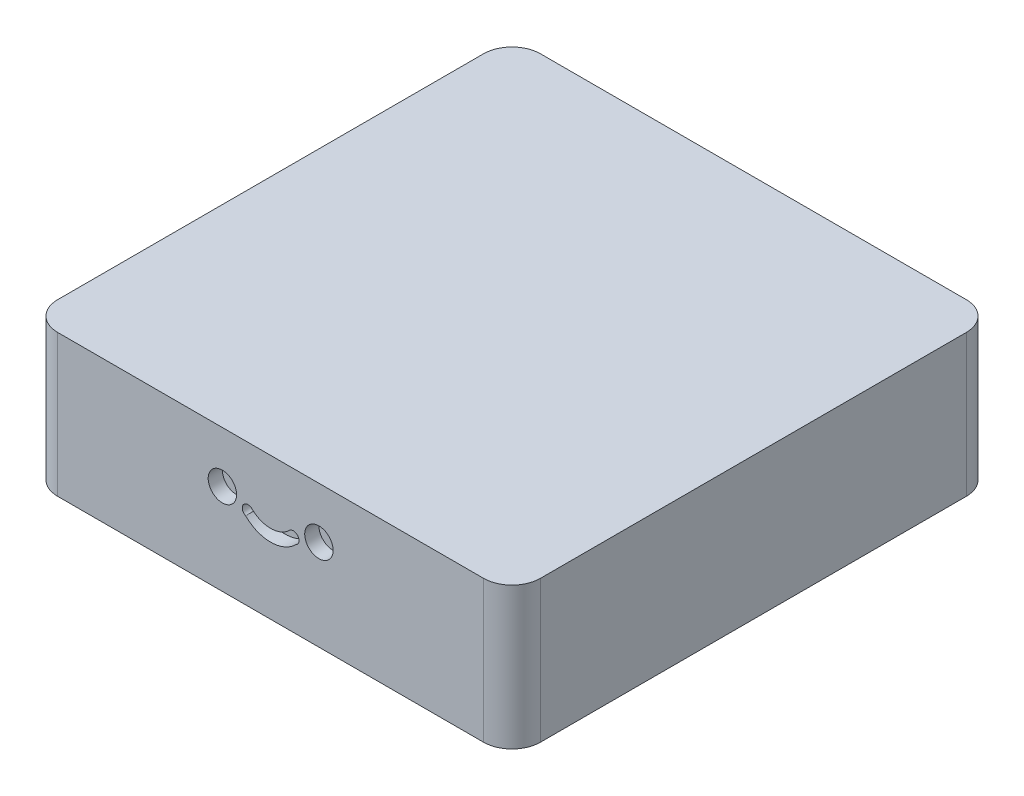
ISO-10303-21;
HEADER;
FILE_DESCRIPTION(('STEP AP214'),'2;1');
FILE_NAME('part.step','',(''),(''),'','','');
FILE_SCHEMA(('AUTOMOTIVE_DESIGN { 1 0 10303 214 1 1 1 1 }'));
ENDSEC;
DATA;
#1=APPLICATION_CONTEXT('core data for automotive mechanical design processes');
#2=APPLICATION_PROTOCOL_DEFINITION('international standard','automotive_design',2000,#1);
#3=PRODUCT_CONTEXT('',#1,'mechanical');
#4=PRODUCT('Part','Part','',(#3));
#5=PRODUCT_RELATED_PRODUCT_CATEGORY('part','',(#4));
#6=PRODUCT_DEFINITION_FORMATION('','',#4);
#7=PRODUCT_DEFINITION_CONTEXT('part definition',#1,'design');
#8=PRODUCT_DEFINITION('design','',#6,#7);
#9=PRODUCT_DEFINITION_SHAPE('','',#8);
#10=(LENGTH_UNIT() NAMED_UNIT(*) SI_UNIT(.MILLI.,.METRE.));
#11=(NAMED_UNIT(*) PLANE_ANGLE_UNIT() SI_UNIT($,.RADIAN.));
#12=(NAMED_UNIT(*) SI_UNIT($,.STERADIAN.) SOLID_ANGLE_UNIT());
#13=UNCERTAINTY_MEASURE_WITH_UNIT(LENGTH_MEASURE(1.E-05),#10,'distance_accuracy_value','');
#14=(GEOMETRIC_REPRESENTATION_CONTEXT(3) GLOBAL_UNCERTAINTY_ASSIGNED_CONTEXT((#13)) GLOBAL_UNIT_ASSIGNED_CONTEXT((#10,
#11,#12)) REPRESENTATION_CONTEXT('',''));
#15=CARTESIAN_POINT('',(0.,0.,0.));
#16=DIRECTION('',(0.,0.,1.));
#17=DIRECTION('',(1.,0.,0.));
#18=AXIS2_PLACEMENT_3D('',#15,#16,#17);
#19=CARTESIAN_POINT('',(0.,0.,0.));
#20=DIRECTION('',(0.,-1.,0.));
#21=DIRECTION('',(0.,0.,-1.));
#22=AXIS2_PLACEMENT_3D('',#19,#20,#21);
#23=PLANE('',#22);
#24=DIRECTION('',(0.,0.,1.));
#25=VECTOR('',#24,1.);
#26=CARTESIAN_POINT('',(0.,0.,0.));
#27=LINE('',#26,#25);
#28=CARTESIAN_POINT('',(0.,0.,-160.));
#29=VERTEX_POINT('',#28);
#30=CARTESIAN_POINT('',(0.,0.,-10.));
#31=VERTEX_POINT('',#30);
#32=EDGE_CURVE('E336',#29,#31,#27,.T.);
#33=ORIENTED_EDGE('',*,*,#32,.F.);
#34=CARTESIAN_POINT('',(10.,0.,-160.));
#35=DIRECTION('',(0.,-1.,0.));
#36=DIRECTION('',(0.,0.,-1.));
#37=AXIS2_PLACEMENT_3D('',#34,#35,#36);
#38=CIRCLE('',#37,10.);
#39=CARTESIAN_POINT('',(10.,0.,-170.));
#40=VERTEX_POINT('',#39);
#41=EDGE_CURVE('E408',#29,#40,#38,.T.);
#42=ORIENTED_EDGE('',*,*,#41,.T.);
#43=DIRECTION('',(-1.,0.,0.));
#44=VECTOR('',#43,1.);
#45=CARTESIAN_POINT('',(0.,0.,-170.));
#46=LINE('',#45,#44);
#47=CARTESIAN_POINT('',(160.,0.,-170.));
#48=VERTEX_POINT('',#47);
#49=EDGE_CURVE('E378',#48,#40,#46,.T.);
#50=ORIENTED_EDGE('',*,*,#49,.F.);
#51=CARTESIAN_POINT('',(160.,0.,-160.));
#52=DIRECTION('',(0.,-1.,0.));
#53=DIRECTION('',(0.,0.,-1.));
#54=AXIS2_PLACEMENT_3D('',#51,#52,#53);
#55=CIRCLE('',#54,10.);
#56=CARTESIAN_POINT('',(170.,0.,-160.));
#57=VERTEX_POINT('',#56);
#58=EDGE_CURVE('E406',#48,#57,#55,.T.);
#59=ORIENTED_EDGE('',*,*,#58,.T.);
#60=DIRECTION('',(0.,0.,-1.));
#61=VECTOR('',#60,1.);
#62=CARTESIAN_POINT('',(170.,0.,0.));
#63=LINE('',#62,#61);
#64=CARTESIAN_POINT('',(170.,0.,-10.));
#65=VERTEX_POINT('',#64);
#66=EDGE_CURVE('E393',#65,#57,#63,.T.);
#67=ORIENTED_EDGE('',*,*,#66,.F.);
#68=CARTESIAN_POINT('',(160.,0.,-10.));
#69=DIRECTION('',(0.,-1.,0.));
#70=DIRECTION('',(0.,0.,-1.));
#71=AXIS2_PLACEMENT_3D('',#68,#69,#70);
#72=CIRCLE('',#71,10.);
#73=CARTESIAN_POINT('',(160.,0.,0.));
#74=VERTEX_POINT('',#73);
#75=EDGE_CURVE('E402',#65,#74,#72,.T.);
#76=ORIENTED_EDGE('',*,*,#75,.T.);
#77=DIRECTION('',(1.,0.,0.));
#78=VECTOR('',#77,1.);
#79=CARTESIAN_POINT('',(0.,0.,0.));
#80=LINE('',#79,#78);
#81=CARTESIAN_POINT('',(10.,0.,0.));
#82=VERTEX_POINT('',#81);
#83=EDGE_CURVE('E390',#82,#74,#80,.T.);
#84=ORIENTED_EDGE('',*,*,#83,.F.);
#85=CARTESIAN_POINT('',(10.,0.,-10.));
#86=DIRECTION('',(0.,-1.,0.));
#87=DIRECTION('',(0.,0.,-1.));
#88=AXIS2_PLACEMENT_3D('',#85,#86,#87);
#89=CIRCLE('',#88,10.);
#90=EDGE_CURVE('E404',#82,#31,#89,.T.);
#91=ORIENTED_EDGE('',*,*,#90,.T.);
#92=EDGE_LOOP('',(#33,#42,#50,#59,#67,#76,#84,#91));
#93=FACE_BOUND('',#92,.T.);
#94=CARTESIAN_POINT('',(10.,0.,-160.));
#95=DIRECTION('',(0.,-1.,0.));
#96=DIRECTION('',(0.,0.,-1.));
#97=AXIS2_PLACEMENT_3D('',#94,#95,#96);
#98=CIRCLE('',#97,7.);
#99=CARTESIAN_POINT('',(3.,0.,-160.));
#100=VERTEX_POINT('',#99);
#101=CARTESIAN_POINT('',(10.,0.,-167.));
#102=VERTEX_POINT('',#101);
#103=EDGE_CURVE('E269',#100,#102,#98,.T.);
#104=ORIENTED_EDGE('',*,*,#103,.F.);
#105=DIRECTION('',(0.,0.,1.));
#106=VECTOR('',#105,1.);
#107=CARTESIAN_POINT('',(3.,0.,0.));
#108=LINE('',#107,#106);
#109=CARTESIAN_POINT('',(3.,0.,-10.));
#110=VERTEX_POINT('',#109);
#111=EDGE_CURVE('E308',#100,#110,#108,.T.);
#112=ORIENTED_EDGE('',*,*,#111,.T.);
#113=CARTESIAN_POINT('',(10.,0.,-10.));
#114=DIRECTION('',(0.,-1.,0.));
#115=DIRECTION('',(0.,0.,-1.));
#116=AXIS2_PLACEMENT_3D('',#113,#114,#115);
#117=CIRCLE('',#116,7.);
#118=CARTESIAN_POINT('',(10.,0.,-3.));
#119=VERTEX_POINT('',#118);
#120=EDGE_CURVE('E311',#119,#110,#117,.T.);
#121=ORIENTED_EDGE('',*,*,#120,.F.);
#122=DIRECTION('',(1.,0.,0.));
#123=VECTOR('',#122,1.);
#124=CARTESIAN_POINT('',(0.,0.,-3.));
#125=LINE('',#124,#123);
#126=CARTESIAN_POINT('',(160.,0.,-3.));
#127=VERTEX_POINT('',#126);
#128=EDGE_CURVE('E55',#119,#127,#125,.T.);
#129=ORIENTED_EDGE('',*,*,#128,.T.);
#130=CARTESIAN_POINT('',(160.,0.,-10.));
#131=DIRECTION('',(0.,-1.,0.));
#132=DIRECTION('',(0.,0.,-1.));
#133=AXIS2_PLACEMENT_3D('',#130,#131,#132);
#134=CIRCLE('',#133,7.);
#135=CARTESIAN_POINT('',(167.,0.,-10.));
#136=VERTEX_POINT('',#135);
#137=EDGE_CURVE('E233',#136,#127,#134,.T.);
#138=ORIENTED_EDGE('',*,*,#137,.F.);
#139=DIRECTION('',(0.,0.,-1.));
#140=VECTOR('',#139,1.);
#141=CARTESIAN_POINT('',(167.,0.,0.));
#142=LINE('',#141,#140);
#143=CARTESIAN_POINT('',(167.,0.,-160.));
#144=VERTEX_POINT('',#143);
#145=EDGE_CURVE('E310',#136,#144,#142,.T.);
#146=ORIENTED_EDGE('',*,*,#145,.T.);
#147=CARTESIAN_POINT('',(160.,0.,-160.));
#148=DIRECTION('',(0.,-1.,0.));
#149=DIRECTION('',(0.,0.,-1.));
#150=AXIS2_PLACEMENT_3D('',#147,#148,#149);
#151=CIRCLE('',#150,7.);
#152=CARTESIAN_POINT('',(160.,0.,-167.));
#153=VERTEX_POINT('',#152);
#154=EDGE_CURVE('E313',#153,#144,#151,.T.);
#155=ORIENTED_EDGE('',*,*,#154,.F.);
#156=DIRECTION('',(-1.,0.,0.));
#157=VECTOR('',#156,1.);
#158=CARTESIAN_POINT('',(0.,0.,-167.));
#159=LINE('',#158,#157);
#160=EDGE_CURVE('E317',#153,#102,#159,.T.);
#161=ORIENTED_EDGE('',*,*,#160,.T.);
#162=EDGE_LOOP('',(#104,#112,#121,#129,#138,#146,#155,#161));
#163=FACE_BOUND('',#162,.T.);
#164=ADVANCED_FACE('F40',(#93,#163),#23,.T.);
#165=CARTESIAN_POINT('',(0.,50.,0.));
#166=DIRECTION('',(0.,0.,-1.));
#167=DIRECTION('',(-1.,0.,0.));
#168=AXIS2_PLACEMENT_3D('',#165,#166,#167);
#169=PLANE('',#168);
#170=CARTESIAN_POINT('',(68.,32.,0.));
#171=DIRECTION('',(0.,0.,1.));
#172=DIRECTION('',(1.,0.,0.));
#173=AXIS2_PLACEMENT_3D('',#170,#171,#172);
#174=CIRCLE('',#173,5.00000000000001);
#175=CARTESIAN_POINT('',(73.,32.,0.));
#176=VERTEX_POINT('',#175);
#177=EDGE_CURVE('E337',#176,#176,#174,.T.);
#178=ORIENTED_EDGE('',*,*,#177,.F.);
#179=EDGE_LOOP('',(#178));
#180=FACE_BOUND('',#179,.T.);
#181=DIRECTION('',(1.,0.,0.));
#182=VECTOR('',#181,1.);
#183=CARTESIAN_POINT('',(0.,50.,0.));
#184=LINE('',#183,#182);
#185=CARTESIAN_POINT('',(10.,50.,0.));
#186=VERTEX_POINT('',#185);
#187=CARTESIAN_POINT('',(160.,50.,0.));
#188=VERTEX_POINT('',#187);
#189=EDGE_CURVE('E377',#186,#188,#184,.T.);
#190=ORIENTED_EDGE('',*,*,#189,.F.);
#191=DIRECTION('',(0.,-1.,0.));
#192=VECTOR('',#191,1.);
#193=CARTESIAN_POINT('',(10.,50.,0.));
#194=LINE('',#193,#192);
#195=EDGE_CURVE('E12',#186,#82,#194,.T.);
#196=ORIENTED_EDGE('',*,*,#195,.T.);
#197=ORIENTED_EDGE('',*,*,#83,.T.);
#198=DIRECTION('',(0.,-1.,0.));
#199=VECTOR('',#198,1.);
#200=CARTESIAN_POINT('',(160.,50.,0.));
#201=LINE('',#200,#199);
#202=EDGE_CURVE('E48',#74,#188,#201,.F.);
#203=ORIENTED_EDGE('',*,*,#202,.T.);
#204=EDGE_LOOP('',(#190,#196,#197,#203));
#205=FACE_BOUND('',#204,.T.);
#206=CARTESIAN_POINT('',(102.,32.,0.));
#207=DIRECTION('',(0.,0.,1.));
#208=DIRECTION('',(1.,0.,0.));
#209=AXIS2_PLACEMENT_3D('',#206,#207,#208);
#210=CIRCLE('',#209,5.00000000000001);
#211=CARTESIAN_POINT('',(107.,32.,0.));
#212=VERTEX_POINT('',#211);
#213=EDGE_CURVE('E332',#212,#212,#210,.T.);
#214=ORIENTED_EDGE('',*,*,#213,.F.);
#215=EDGE_LOOP('',(#214));
#216=FACE_BOUND('',#215,.T.);
#217=CARTESIAN_POINT('',(85.,37.1309503384281,0.));
#218=DIRECTION('',(0.,0.,1.));
#219=DIRECTION('',(1.,0.,0.));
#220=AXIS2_PLACEMENT_3D('',#217,#218,#219);
#221=CIRCLE('',#220,9.40844902005735);
#222=CARTESIAN_POINT('',(78.4561054884062,30.3710422337161,0.));
#223=VERTEX_POINT('',#222);
#224=CARTESIAN_POINT('',(91.6527781025305,30.4781722358977,0.));
#225=VERTEX_POINT('',#224);
#226=EDGE_CURVE('E63',#223,#225,#221,.T.);
#227=ORIENTED_EDGE('',*,*,#226,.T.);
#228=CARTESIAN_POINT('',(93.,29.,0.));
#229=DIRECTION('',(0.,0.,1.));
#230=DIRECTION('',(1.,0.,0.));
#231=AXIS2_PLACEMENT_3D('',#228,#229,#230);
#232=CIRCLE('',#231,2.);
#233=CARTESIAN_POINT('',(93.8421104782793,27.1859300062092,0.));
#234=VERTEX_POINT('',#233);
#235=EDGE_CURVE('E345',#225,#234,#232,.F.);
#236=ORIENTED_EDGE('',*,*,#235,.T.);
#237=CARTESIAN_POINT('',(85.0073184568654,36.0084889303069,0.));
#238=DIRECTION('',(0.,0.,1.));
#239=DIRECTION('',(1.,0.,0.));
#240=AXIS2_PLACEMENT_3D('',#237,#238,#239);
#241=CIRCLE('',#240,12.485635587779);
#242=CARTESIAN_POINT('',(76.1847595327677,27.173696908893,0.));
#243=VERTEX_POINT('',#242);
#244=EDGE_CURVE('E359',#243,#234,#241,.T.);
#245=ORIENTED_EDGE('',*,*,#244,.F.);
#246=CARTESIAN_POINT('',(77.,29.,0.));
#247=DIRECTION('',(0.,0.,1.));
#248=DIRECTION('',(1.,0.,0.));
#249=AXIS2_PLACEMENT_3D('',#246,#247,#248);
#250=CIRCLE('',#249,2.);
#251=EDGE_CURVE('E355',#223,#243,#250,.T.);
#252=ORIENTED_EDGE('',*,*,#251,.F.);
#253=EDGE_LOOP('',(#227,#236,#245,#252));
#254=FACE_BOUND('',#253,.T.);
#255=ADVANCED_FACE('F430',(#180,#205,#216,#254),#169,.F.);
#256=CARTESIAN_POINT('',(0.,50.,0.));
#257=DIRECTION('',(1.,0.,0.));
#258=DIRECTION('',(0.,0.,-1.));
#259=AXIS2_PLACEMENT_3D('',#256,#257,#258);
#260=PLANE('',#259);
#261=DIRECTION('',(0.,0.,1.));
#262=VECTOR('',#261,1.);
#263=CARTESIAN_POINT('',(0.,50.,0.));
#264=LINE('',#263,#262);
#265=CARTESIAN_POINT('',(0.,50.,-160.));
#266=VERTEX_POINT('',#265);
#267=CARTESIAN_POINT('',(0.,50.,-10.));
#268=VERTEX_POINT('',#267);
#269=EDGE_CURVE('E374',#266,#268,#264,.T.);
#270=ORIENTED_EDGE('',*,*,#269,.F.);
#271=DIRECTION('',(0.,-1.,0.));
#272=VECTOR('',#271,1.);
#273=CARTESIAN_POINT('',(0.,50.,-160.));
#274=LINE('',#273,#272);
#275=EDGE_CURVE('E399',#266,#29,#274,.T.);
#276=ORIENTED_EDGE('',*,*,#275,.T.);
#277=ORIENTED_EDGE('',*,*,#32,.T.);
#278=DIRECTION('',(0.,-1.,0.));
#279=VECTOR('',#278,1.);
#280=CARTESIAN_POINT('',(0.,50.,-10.));
#281=LINE('',#280,#279);
#282=EDGE_CURVE('E387',#31,#268,#281,.F.);
#283=ORIENTED_EDGE('',*,*,#282,.T.);
#284=EDGE_LOOP('',(#270,#276,#277,#283));
#285=FACE_BOUND('',#284,.T.);
#286=ADVANCED_FACE('F463',(#285),#260,.F.);
#287=CARTESIAN_POINT('',(170.,50.,0.));
#288=DIRECTION('',(-1.,0.,0.));
#289=DIRECTION('',(0.,0.,1.));
#290=AXIS2_PLACEMENT_3D('',#287,#288,#289);
#291=PLANE('',#290);
#292=ORIENTED_EDGE('',*,*,#66,.T.);
#293=DIRECTION('',(0.,-1.,0.));
#294=VECTOR('',#293,1.);
#295=CARTESIAN_POINT('',(170.,50.,-160.));
#296=LINE('',#295,#294);
#297=CARTESIAN_POINT('',(170.,50.,-160.));
#298=VERTEX_POINT('',#297);
#299=EDGE_CURVE('E426',#57,#298,#296,.F.);
#300=ORIENTED_EDGE('',*,*,#299,.T.);
#301=DIRECTION('',(0.,0.,-1.));
#302=VECTOR('',#301,1.);
#303=CARTESIAN_POINT('',(170.,50.,0.));
#304=LINE('',#303,#302);
#305=CARTESIAN_POINT('',(170.,50.,-10.));
#306=VERTEX_POINT('',#305);
#307=EDGE_CURVE('E381',#306,#298,#304,.T.);
#308=ORIENTED_EDGE('',*,*,#307,.F.);
#309=DIRECTION('',(0.,-1.,0.));
#310=VECTOR('',#309,1.);
#311=CARTESIAN_POINT('',(170.,50.,-10.));
#312=LINE('',#311,#310);
#313=EDGE_CURVE('E423',#306,#65,#312,.T.);
#314=ORIENTED_EDGE('',*,*,#313,.T.);
#315=EDGE_LOOP('',(#292,#300,#308,#314));
#316=FACE_BOUND('',#315,.T.);
#317=ADVANCED_FACE('F443',(#316),#291,.F.);
#318=CARTESIAN_POINT('',(0.,50.,-170.));
#319=DIRECTION('',(0.,0.,1.));
#320=DIRECTION('',(1.,0.,0.));
#321=AXIS2_PLACEMENT_3D('',#318,#319,#320);
#322=PLANE('',#321);
#323=ORIENTED_EDGE('',*,*,#49,.T.);
#324=DIRECTION('',(0.,-1.,0.));
#325=VECTOR('',#324,1.);
#326=CARTESIAN_POINT('',(10.,50.,-170.));
#327=LINE('',#326,#325);
#328=CARTESIAN_POINT('',(10.,50.,-170.));
#329=VERTEX_POINT('',#328);
#330=EDGE_CURVE('E413',#40,#329,#327,.F.);
#331=ORIENTED_EDGE('',*,*,#330,.T.);
#332=DIRECTION('',(-1.,0.,0.));
#333=VECTOR('',#332,1.);
#334=CARTESIAN_POINT('',(0.,50.,-170.));
#335=LINE('',#334,#333);
#336=CARTESIAN_POINT('',(160.,50.,-170.));
#337=VERTEX_POINT('',#336);
#338=EDGE_CURVE('E384',#337,#329,#335,.T.);
#339=ORIENTED_EDGE('',*,*,#338,.F.);
#340=DIRECTION('',(0.,-1.,0.));
#341=VECTOR('',#340,1.);
#342=CARTESIAN_POINT('',(160.,50.,-170.));
#343=LINE('',#342,#341);
#344=EDGE_CURVE('E410',#337,#48,#343,.T.);
#345=ORIENTED_EDGE('',*,*,#344,.T.);
#346=EDGE_LOOP('',(#323,#331,#339,#345));
#347=FACE_BOUND('',#346,.T.);
#348=ADVANCED_FACE('F455',(#347),#322,.F.);
#349=CARTESIAN_POINT('',(0.,50.,0.));
#350=DIRECTION('',(0.,-1.,0.));
#351=DIRECTION('',(0.,0.,-1.));
#352=AXIS2_PLACEMENT_3D('',#349,#350,#351);
#353=PLANE('',#352);
#354=ORIENTED_EDGE('',*,*,#338,.T.);
#355=CARTESIAN_POINT('',(10.,50.,-160.));
#356=DIRECTION('',(0.,-1.,0.));
#357=DIRECTION('',(0.,0.,-1.));
#358=AXIS2_PLACEMENT_3D('',#355,#356,#357);
#359=CIRCLE('',#358,10.);
#360=EDGE_CURVE('E421',#329,#266,#359,.F.);
#361=ORIENTED_EDGE('',*,*,#360,.T.);
#362=ORIENTED_EDGE('',*,*,#269,.T.);
#363=CARTESIAN_POINT('',(10.,50.,-10.));
#364=DIRECTION('',(0.,-1.,0.));
#365=DIRECTION('',(0.,0.,-1.));
#366=AXIS2_PLACEMENT_3D('',#363,#364,#365);
#367=CIRCLE('',#366,10.);
#368=EDGE_CURVE('E417',#268,#186,#367,.F.);
#369=ORIENTED_EDGE('',*,*,#368,.T.);
#370=ORIENTED_EDGE('',*,*,#189,.T.);
#371=CARTESIAN_POINT('',(160.,50.,-10.));
#372=DIRECTION('',(0.,-1.,0.));
#373=DIRECTION('',(0.,0.,-1.));
#374=AXIS2_PLACEMENT_3D('',#371,#372,#373);
#375=CIRCLE('',#374,10.);
#376=EDGE_CURVE('E415',#188,#306,#375,.F.);
#377=ORIENTED_EDGE('',*,*,#376,.T.);
#378=ORIENTED_EDGE('',*,*,#307,.T.);
#379=CARTESIAN_POINT('',(160.,50.,-160.));
#380=DIRECTION('',(0.,-1.,0.));
#381=DIRECTION('',(0.,0.,-1.));
#382=AXIS2_PLACEMENT_3D('',#379,#380,#381);
#383=CIRCLE('',#382,10.);
#384=EDGE_CURVE('E419',#298,#337,#383,.F.);
#385=ORIENTED_EDGE('',*,*,#384,.T.);
#386=EDGE_LOOP('',(#354,#361,#362,#369,#370,#377,#378,#385));
#387=FACE_BOUND('',#386,.T.);
#388=ADVANCED_FACE('F437',(#387),#353,.F.);
#389=CARTESIAN_POINT('',(10.,50.,-160.));
#390=DIRECTION('',(0.,-1.,0.));
#391=DIRECTION('',(0.,0.,-1.));
#392=AXIS2_PLACEMENT_3D('',#389,#390,#391);
#393=CYLINDRICAL_SURFACE('',#392,10.);
#394=ORIENTED_EDGE('',*,*,#360,.F.);
#395=ORIENTED_EDGE('',*,*,#330,.F.);
#396=ORIENTED_EDGE('',*,*,#41,.F.);
#397=ORIENTED_EDGE('',*,*,#275,.F.);
#398=EDGE_LOOP('',(#394,#395,#396,#397));
#399=FACE_BOUND('',#398,.T.);
#400=ADVANCED_FACE('F461',(#399),#393,.T.);
#401=CARTESIAN_POINT('',(160.,50.,-160.));
#402=DIRECTION('',(0.,-1.,0.));
#403=DIRECTION('',(0.,0.,-1.));
#404=AXIS2_PLACEMENT_3D('',#401,#402,#403);
#405=CYLINDRICAL_SURFACE('',#404,10.);
#406=ORIENTED_EDGE('',*,*,#384,.F.);
#407=ORIENTED_EDGE('',*,*,#299,.F.);
#408=ORIENTED_EDGE('',*,*,#58,.F.);
#409=ORIENTED_EDGE('',*,*,#344,.F.);
#410=EDGE_LOOP('',(#406,#407,#408,#409));
#411=FACE_BOUND('',#410,.T.);
#412=ADVANCED_FACE('F452',(#411),#405,.T.);
#413=CARTESIAN_POINT('',(10.,50.,-10.));
#414=DIRECTION('',(0.,-1.,0.));
#415=DIRECTION('',(0.,0.,-1.));
#416=AXIS2_PLACEMENT_3D('',#413,#414,#415);
#417=CYLINDRICAL_SURFACE('',#416,10.);
#418=ORIENTED_EDGE('',*,*,#368,.F.);
#419=ORIENTED_EDGE('',*,*,#282,.F.);
#420=ORIENTED_EDGE('',*,*,#90,.F.);
#421=ORIENTED_EDGE('',*,*,#195,.F.);
#422=EDGE_LOOP('',(#418,#419,#420,#421));
#423=FACE_BOUND('',#422,.T.);
#424=ADVANCED_FACE('F466',(#423),#417,.T.);
#425=CARTESIAN_POINT('',(160.,50.,-10.));
#426=DIRECTION('',(0.,-1.,0.));
#427=DIRECTION('',(0.,0.,-1.));
#428=AXIS2_PLACEMENT_3D('',#425,#426,#427);
#429=CYLINDRICAL_SURFACE('',#428,10.);
#430=ORIENTED_EDGE('',*,*,#376,.F.);
#431=ORIENTED_EDGE('',*,*,#202,.F.);
#432=ORIENTED_EDGE('',*,*,#75,.F.);
#433=ORIENTED_EDGE('',*,*,#313,.F.);
#434=EDGE_LOOP('',(#430,#431,#432,#433));
#435=FACE_BOUND('',#434,.T.);
#436=ADVANCED_FACE('F42',(#435),#429,.T.);
#437=CARTESIAN_POINT('',(102.,32.,-5.));
#438=DIRECTION('',(0.,0.,1.));
#439=DIRECTION('',(1.,0.,0.));
#440=AXIS2_PLACEMENT_3D('',#437,#438,#439);
#441=CYLINDRICAL_SURFACE('',#440,5.00000000000001);
#442=CARTESIAN_POINT('',(102.,32.,-5.));
#443=DIRECTION('',(0.,0.,1.));
#444=DIRECTION('',(1.,0.,0.));
#445=AXIS2_PLACEMENT_3D('',#442,#443,#444);
#446=CIRCLE('',#445,5.00000000000001);
#447=CARTESIAN_POINT('',(107.,32.,-5.));
#448=VERTEX_POINT('',#447);
#449=EDGE_CURVE('E356',#448,#448,#446,.T.);
#450=ORIENTED_EDGE('',*,*,#449,.F.);
#451=EDGE_LOOP('',(#450));
#452=FACE_BOUND('',#451,.T.);
#453=ORIENTED_EDGE('',*,*,#213,.T.);
#454=EDGE_LOOP('',(#453));
#455=FACE_BOUND('',#454,.T.);
#456=ADVANCED_FACE('F472',(#452,#455),#441,.F.);
#457=CARTESIAN_POINT('',(0.,0.,-5.));
#458=DIRECTION('',(0.,0.,1.));
#459=DIRECTION('',(1.,0.,0.));
#460=AXIS2_PLACEMENT_3D('',#457,#458,#459);
#461=PLANE('',#460);
#462=ORIENTED_EDGE('',*,*,#449,.T.);
#463=EDGE_LOOP('',(#462));
#464=FACE_BOUND('',#463,.T.);
#465=ADVANCED_FACE('F528',(#464),#461,.T.);
#466=CARTESIAN_POINT('',(85.,37.1309503384281,-5.));
#467=DIRECTION('',(0.,0.,1.));
#468=DIRECTION('',(1.,0.,0.));
#469=AXIS2_PLACEMENT_3D('',#466,#467,#468);
#470=CYLINDRICAL_SURFACE('',#469,9.40844902005735);
#471=ORIENTED_EDGE('',*,*,#226,.F.);
#472=DIRECTION('',(0.,0.,1.));
#473=VECTOR('',#472,1.);
#474=CARTESIAN_POINT('',(78.4561054884062,30.3710422337161,-5.));
#475=LINE('',#474,#473);
#476=CARTESIAN_POINT('',(78.4561054884062,30.3710422337161,-5.));
#477=VERTEX_POINT('',#476);
#478=EDGE_CURVE('E353',#477,#223,#475,.T.);
#479=ORIENTED_EDGE('',*,*,#478,.F.);
#480=CARTESIAN_POINT('',(85.,37.1309503384281,-5.));
#481=DIRECTION('',(0.,0.,1.));
#482=DIRECTION('',(1.,0.,0.));
#483=AXIS2_PLACEMENT_3D('',#480,#481,#482);
#484=CIRCLE('',#483,9.40844902005735);
#485=CARTESIAN_POINT('',(91.6527781025305,30.4781722358977,-5.));
#486=VERTEX_POINT('',#485);
#487=EDGE_CURVE('E341',#477,#486,#484,.T.);
#488=ORIENTED_EDGE('',*,*,#487,.T.);
#489=DIRECTION('',(0.,0.,1.));
#490=VECTOR('',#489,1.);
#491=CARTESIAN_POINT('',(91.6527781025305,30.4781722358977,-5.));
#492=LINE('',#491,#490);
#493=EDGE_CURVE('E340',#486,#225,#492,.T.);
#494=ORIENTED_EDGE('',*,*,#493,.T.);
#495=EDGE_LOOP('',(#471,#479,#488,#494));
#496=FACE_BOUND('',#495,.T.);
#497=ADVANCED_FACE('F537',(#496),#470,.T.);
#498=CARTESIAN_POINT('',(93.,29.,-5.));
#499=DIRECTION('',(0.,0.,1.));
#500=DIRECTION('',(1.,0.,0.));
#501=AXIS2_PLACEMENT_3D('',#498,#499,#500);
#502=CYLINDRICAL_SURFACE('',#501,2.);
#503=ORIENTED_EDGE('',*,*,#235,.F.);
#504=ORIENTED_EDGE('',*,*,#493,.F.);
#505=CARTESIAN_POINT('',(93.,29.,-5.));
#506=DIRECTION('',(0.,0.,1.));
#507=DIRECTION('',(1.,0.,0.));
#508=AXIS2_PLACEMENT_3D('',#505,#506,#507);
#509=CIRCLE('',#508,2.);
#510=CARTESIAN_POINT('',(93.8421104782793,27.1859300062092,-5.));
#511=VERTEX_POINT('',#510);
#512=EDGE_CURVE('E351',#486,#511,#509,.F.);
#513=ORIENTED_EDGE('',*,*,#512,.T.);
#514=DIRECTION('',(0.,0.,1.));
#515=VECTOR('',#514,1.);
#516=CARTESIAN_POINT('',(93.8421104782793,27.1859300062092,-5.));
#517=LINE('',#516,#515);
#518=EDGE_CURVE('E365',#511,#234,#517,.T.);
#519=ORIENTED_EDGE('',*,*,#518,.T.);
#520=EDGE_LOOP('',(#503,#504,#513,#519));
#521=FACE_BOUND('',#520,.T.);
#522=ADVANCED_FACE('F548',(#521),#502,.F.);
#523=CARTESIAN_POINT('',(85.0073184568654,36.0084889303069,-5.));
#524=DIRECTION('',(0.,0.,1.));
#525=DIRECTION('',(1.,0.,0.));
#526=AXIS2_PLACEMENT_3D('',#523,#524,#525);
#527=CYLINDRICAL_SURFACE('',#526,12.485635587779);
#528=ORIENTED_EDGE('',*,*,#244,.T.);
#529=ORIENTED_EDGE('',*,*,#518,.F.);
#530=CARTESIAN_POINT('',(85.0073184568654,36.0084889303069,-5.));
#531=DIRECTION('',(0.,0.,1.));
#532=DIRECTION('',(1.,0.,0.));
#533=AXIS2_PLACEMENT_3D('',#530,#531,#532);
#534=CIRCLE('',#533,12.485635587779);
#535=CARTESIAN_POINT('',(76.1847595327677,27.173696908893,-5.));
#536=VERTEX_POINT('',#535);
#537=EDGE_CURVE('E348',#536,#511,#534,.T.);
#538=ORIENTED_EDGE('',*,*,#537,.F.);
#539=DIRECTION('',(0.,0.,1.));
#540=VECTOR('',#539,1.);
#541=CARTESIAN_POINT('',(76.1847595327677,27.173696908893,-5.));
#542=LINE('',#541,#540);
#543=EDGE_CURVE('E367',#536,#243,#542,.T.);
#544=ORIENTED_EDGE('',*,*,#543,.T.);
#545=EDGE_LOOP('',(#528,#529,#538,#544));
#546=FACE_BOUND('',#545,.T.);
#547=ADVANCED_FACE('F558',(#546),#527,.F.);
#548=CARTESIAN_POINT('',(77.,29.,-5.));
#549=DIRECTION('',(0.,0.,1.));
#550=DIRECTION('',(1.,0.,0.));
#551=AXIS2_PLACEMENT_3D('',#548,#549,#550);
#552=CYLINDRICAL_SURFACE('',#551,2.);
#553=ORIENTED_EDGE('',*,*,#251,.T.);
#554=ORIENTED_EDGE('',*,*,#543,.F.);
#555=CARTESIAN_POINT('',(77.,29.,-5.));
#556=DIRECTION('',(0.,0.,1.));
#557=DIRECTION('',(1.,0.,0.));
#558=AXIS2_PLACEMENT_3D('',#555,#556,#557);
#559=CIRCLE('',#558,2.);
#560=EDGE_CURVE('E344',#477,#536,#559,.T.);
#561=ORIENTED_EDGE('',*,*,#560,.F.);
#562=ORIENTED_EDGE('',*,*,#478,.T.);
#563=EDGE_LOOP('',(#553,#554,#561,#562));
#564=FACE_BOUND('',#563,.T.);
#565=ADVANCED_FACE('F569',(#564),#552,.F.);
#566=CARTESIAN_POINT('',(0.,0.,-5.));
#567=DIRECTION('',(0.,0.,1.));
#568=DIRECTION('',(1.,0.,0.));
#569=AXIS2_PLACEMENT_3D('',#566,#567,#568);
#570=PLANE('',#569);
#571=ORIENTED_EDGE('',*,*,#487,.F.);
#572=ORIENTED_EDGE('',*,*,#560,.T.);
#573=ORIENTED_EDGE('',*,*,#537,.T.);
#574=ORIENTED_EDGE('',*,*,#512,.F.);
#575=EDGE_LOOP('',(#571,#572,#573,#574));
#576=FACE_BOUND('',#575,.T.);
#577=ADVANCED_FACE('F580',(#576),#570,.T.);
#578=CARTESIAN_POINT('',(68.,32.,-5.));
#579=DIRECTION('',(0.,0.,1.));
#580=DIRECTION('',(1.,0.,0.));
#581=AXIS2_PLACEMENT_3D('',#578,#579,#580);
#582=CYLINDRICAL_SURFACE('',#581,5.00000000000001);
#583=CARTESIAN_POINT('',(68.,32.,-5.));
#584=DIRECTION('',(0.,0.,1.));
#585=DIRECTION('',(1.,0.,0.));
#586=AXIS2_PLACEMENT_3D('',#583,#584,#585);
#587=CIRCLE('',#586,5.00000000000001);
#588=CARTESIAN_POINT('',(73.,32.,-5.));
#589=VERTEX_POINT('',#588);
#590=EDGE_CURVE('E333',#589,#589,#587,.T.);
#591=ORIENTED_EDGE('',*,*,#590,.F.);
#592=EDGE_LOOP('',(#591));
#593=FACE_BOUND('',#592,.T.);
#594=ORIENTED_EDGE('',*,*,#177,.T.);
#595=EDGE_LOOP('',(#594));
#596=FACE_BOUND('',#595,.T.);
#597=ADVANCED_FACE('F591',(#593,#596),#582,.F.);
#598=CARTESIAN_POINT('',(0.,0.,-5.));
#599=DIRECTION('',(0.,0.,1.));
#600=DIRECTION('',(1.,0.,0.));
#601=AXIS2_PLACEMENT_3D('',#598,#599,#600);
#602=PLANE('',#601);
#603=ORIENTED_EDGE('',*,*,#590,.T.);
#604=EDGE_LOOP('',(#603));
#605=FACE_BOUND('',#604,.T.);
#606=ADVANCED_FACE('F601',(#605),#602,.T.);
#607=CARTESIAN_POINT('',(77.,29.,-5.));
#608=DIRECTION('',(0.,0.,1.));
#609=DIRECTION('',(1.,0.,0.));
#610=AXIS2_PLACEMENT_3D('',#607,#608,#609);
#611=CYLINDRICAL_SURFACE('',#610,5.);
#612=CARTESIAN_POINT('',(77.,29.,-3.));
#613=DIRECTION('',(0.,0.,-1.));
#614=DIRECTION('',(-1.,0.,0.));
#615=AXIS2_PLACEMENT_3D('',#612,#613,#614);
#616=CIRCLE('',#615,5.);
#617=CARTESIAN_POINT('',(80.5770708275547,32.4935031550948,-3.));
#618=VERTEX_POINT('',#617);
#619=CARTESIAN_POINT('',(75.7832291625974,33.849687487792,-3.));
#620=VERTEX_POINT('',#619);
#621=EDGE_CURVE('E842',#618,#620,#616,.F.);
#622=ORIENTED_EDGE('',*,*,#621,.F.);
#623=DIRECTION('',(0.,0.,1.));
#624=VECTOR('',#623,1.);
#625=CARTESIAN_POINT('',(80.5770708275547,32.4935031550948,-8.));
#626=LINE('',#625,#624);
#627=CARTESIAN_POINT('',(80.5770708275547,32.4935031550948,-8.));
#628=VERTEX_POINT('',#627);
#629=EDGE_CURVE('E278',#628,#618,#626,.T.);
#630=ORIENTED_EDGE('',*,*,#629,.F.);
#631=CARTESIAN_POINT('',(77.,29.,-8.));
#632=DIRECTION('',(0.,0.,1.));
#633=DIRECTION('',(1.,0.,0.));
#634=AXIS2_PLACEMENT_3D('',#631,#632,#633);
#635=CIRCLE('',#634,5.);
#636=CARTESIAN_POINT('',(75.7832291625974,33.849687487792,-8.));
#637=VERTEX_POINT('',#636);
#638=EDGE_CURVE('E301',#628,#637,#635,.T.);
#639=ORIENTED_EDGE('',*,*,#638,.T.);
#640=DIRECTION('',(0.,0.,-1.));
#641=VECTOR('',#640,1.);
#642=CARTESIAN_POINT('',(75.7832291625974,33.849687487792,-5.));
#643=LINE('',#642,#641);
#644=EDGE_CURVE('E330',#620,#637,#643,.T.);
#645=ORIENTED_EDGE('',*,*,#644,.F.);
#646=EDGE_LOOP('',(#622,#630,#639,#645));
#647=FACE_BOUND('',#646,.T.);
#648=ADVANCED_FACE('F611',(#647),#611,.T.);
#649=CARTESIAN_POINT('',(93.,29.,-5.));
#650=DIRECTION('',(0.,0.,1.));
#651=DIRECTION('',(1.,0.,0.));
#652=AXIS2_PLACEMENT_3D('',#649,#650,#651);
#653=CYLINDRICAL_SURFACE('',#652,5.);
#654=DIRECTION('',(0.,0.,-1.));
#655=VECTOR('',#654,1.);
#656=CARTESIAN_POINT('',(96.8832291625973,25.850312512208,-5.));
#657=LINE('',#656,#655);
#658=CARTESIAN_POINT('',(96.8832291625973,25.850312512208,-8.));
#659=VERTEX_POINT('',#658);
#660=CARTESIAN_POINT('',(96.8832291625973,25.850312512208,-3.));
#661=VERTEX_POINT('',#660);
#662=EDGE_CURVE('E326',#659,#661,#657,.F.);
#663=ORIENTED_EDGE('',*,*,#662,.T.);
#664=CARTESIAN_POINT('',(93.,29.,-3.));
#665=DIRECTION('',(0.,0.,-1.));
#666=DIRECTION('',(-1.,0.,0.));
#667=AXIS2_PLACEMENT_3D('',#664,#665,#666);
#668=CIRCLE('',#667,5.);
#669=CARTESIAN_POINT('',(95.651384912859,24.7608776800065,-3.));
#670=VERTEX_POINT('',#669);
#671=EDGE_CURVE('E853',#661,#670,#668,.T.);
#672=ORIENTED_EDGE('',*,*,#671,.T.);
#673=DIRECTION('',(0.,0.,1.));
#674=VECTOR('',#673,1.);
#675=CARTESIAN_POINT('',(95.651384912859,24.7608776800065,-8.));
#676=LINE('',#675,#674);
#677=CARTESIAN_POINT('',(95.651384912859,24.7608776800065,-8.));
#678=VERTEX_POINT('',#677);
#679=EDGE_CURVE('E292',#678,#670,#676,.T.);
#680=ORIENTED_EDGE('',*,*,#679,.F.);
#681=CARTESIAN_POINT('',(93.,29.,-8.));
#682=DIRECTION('',(0.,0.,1.));
#683=DIRECTION('',(1.,0.,0.));
#684=AXIS2_PLACEMENT_3D('',#681,#682,#683);
#685=CIRCLE('',#684,5.);
#686=EDGE_CURVE('E295',#659,#678,#685,.F.);
#687=ORIENTED_EDGE('',*,*,#686,.F.);
#688=EDGE_LOOP('',(#663,#672,#680,#687));
#689=FACE_BOUND('',#688,.T.);
#690=ADVANCED_FACE('F629',(#689),#653,.T.);
#691=CARTESIAN_POINT('',(0.,50.,-3.));
#692=DIRECTION('',(0.,0.,-1.));
#693=DIRECTION('',(-1.,0.,0.));
#694=AXIS2_PLACEMENT_3D('',#691,#692,#693);
#695=PLANE('',#694);
#696=DIRECTION('',(1.,0.,0.));
#697=VECTOR('',#696,1.);
#698=CARTESIAN_POINT('',(0.,47.,-3.));
#699=LINE('',#698,#697);
#700=CARTESIAN_POINT('',(10.,47.,-3.));
#701=VERTEX_POINT('',#700);
#702=CARTESIAN_POINT('',(160.,47.,-3.));
#703=VERTEX_POINT('',#702);
#704=EDGE_CURVE('E238',#701,#703,#699,.T.);
#705=ORIENTED_EDGE('',*,*,#704,.T.);
#706=DIRECTION('',(0.,1.,0.));
#707=VECTOR('',#706,1.);
#708=CARTESIAN_POINT('',(160.,50.,-3.));
#709=LINE('',#708,#707);
#710=EDGE_CURVE('E226',#127,#703,#709,.T.);
#711=ORIENTED_EDGE('',*,*,#710,.F.);
#712=ORIENTED_EDGE('',*,*,#128,.F.);
#713=DIRECTION('',(0.,1.,0.));
#714=VECTOR('',#713,1.);
#715=CARTESIAN_POINT('',(10.,50.,-3.));
#716=LINE('',#715,#714);
#717=EDGE_CURVE('E234',#701,#119,#716,.F.);
#718=ORIENTED_EDGE('',*,*,#717,.F.);
#719=EDGE_LOOP('',(#705,#711,#712,#718));
#720=FACE_BOUND('',#719,.T.);
#721=CARTESIAN_POINT('',(89.5650304438126,32.6333158613126,-3.));
#722=VERTEX_POINT('',#721);
#723=CARTESIAN_POINT('',(94.2167708374027,33.849687487792,-3.));
#724=VERTEX_POINT('',#723);
#725=EDGE_CURVE('E287',#722,#724,#668,.T.);
#726=ORIENTED_EDGE('',*,*,#725,.F.);
#727=CARTESIAN_POINT('',(85.,37.1309503384281,-3.));
#728=DIRECTION('',(0.,0.,-1.));
#729=DIRECTION('',(-1.,0.,0.));
#730=AXIS2_PLACEMENT_3D('',#727,#728,#729);
#731=CIRCLE('',#730,6.40844902005735);
#732=EDGE_CURVE('E276',#618,#722,#731,.F.);
#733=ORIENTED_EDGE('',*,*,#732,.F.);
#734=ORIENTED_EDGE('',*,*,#621,.T.);
#735=CARTESIAN_POINT('',(68.,32.,-3.));
#736=DIRECTION('',(0.,0.,-1.));
#737=DIRECTION('',(-1.,0.,0.));
#738=AXIS2_PLACEMENT_3D('',#735,#736,#737);
#739=CIRCLE('',#738,8.00000000000001);
#740=CARTESIAN_POINT('',(73.1167708374027,25.850312512208,-3.));
#741=VERTEX_POINT('',#740);
#742=EDGE_CURVE('E291',#620,#741,#739,.F.);
#743=ORIENTED_EDGE('',*,*,#742,.T.);
#744=CARTESIAN_POINT('',(74.3910685498791,24.7346188108712,-3.));
#745=VERTEX_POINT('',#744);
#746=EDGE_CURVE('E860',#741,#745,#616,.F.);
#747=ORIENTED_EDGE('',*,*,#746,.T.);
#748=CARTESIAN_POINT('',(85.0073184568654,36.0084889303069,-3.));
#749=DIRECTION('',(0.,0.,-1.));
#750=DIRECTION('',(-1.,0.,0.));
#751=AXIS2_PLACEMENT_3D('',#748,#749,#750);
#752=CIRCLE('',#751,15.485635587779);
#753=EDGE_CURVE('E857',#745,#670,#752,.F.);
#754=ORIENTED_EDGE('',*,*,#753,.T.);
#755=ORIENTED_EDGE('',*,*,#671,.F.);
#756=CARTESIAN_POINT('',(102.,32.,-3.));
#757=DIRECTION('',(0.,0.,-1.));
#758=DIRECTION('',(-1.,0.,0.));
#759=AXIS2_PLACEMENT_3D('',#756,#757,#758);
#760=CIRCLE('',#759,8.00000000000001);
#761=EDGE_CURVE('E277',#661,#724,#760,.F.);
#762=ORIENTED_EDGE('',*,*,#761,.T.);
#763=EDGE_LOOP('',(#726,#733,#734,#743,#747,#754,#755,#762));
#764=FACE_BOUND('',#763,.T.);
#765=ADVANCED_FACE('F239',(#720,#764),#695,.T.);
#766=CARTESIAN_POINT('',(3.,50.,0.));
#767=DIRECTION('',(1.,0.,0.));
#768=DIRECTION('',(0.,0.,-1.));
#769=AXIS2_PLACEMENT_3D('',#766,#767,#768);
#770=PLANE('',#769);
#771=DIRECTION('',(0.,0.,1.));
#772=VECTOR('',#771,1.);
#773=CARTESIAN_POINT('',(3.,47.,0.));
#774=LINE('',#773,#772);
#775=CARTESIAN_POINT('',(3.,47.,-160.));
#776=VERTEX_POINT('',#775);
#777=CARTESIAN_POINT('',(3.,47.,-10.));
#778=VERTEX_POINT('',#777);
#779=EDGE_CURVE('E244',#776,#778,#774,.T.);
#780=ORIENTED_EDGE('',*,*,#779,.T.);
#781=DIRECTION('',(0.,1.,0.));
#782=VECTOR('',#781,1.);
#783=CARTESIAN_POINT('',(3.,50.,-10.));
#784=LINE('',#783,#782);
#785=EDGE_CURVE('E266',#110,#778,#784,.T.);
#786=ORIENTED_EDGE('',*,*,#785,.F.);
#787=ORIENTED_EDGE('',*,*,#111,.F.);
#788=DIRECTION('',(0.,1.,0.));
#789=VECTOR('',#788,1.);
#790=CARTESIAN_POINT('',(3.,50.,-160.));
#791=LINE('',#790,#789);
#792=EDGE_CURVE('E264',#776,#100,#791,.F.);
#793=ORIENTED_EDGE('',*,*,#792,.F.);
#794=EDGE_LOOP('',(#780,#786,#787,#793));
#795=FACE_BOUND('',#794,.T.);
#796=ADVANCED_FACE('F655',(#795),#770,.T.);
#797=CARTESIAN_POINT('',(167.,50.,0.));
#798=DIRECTION('',(-1.,0.,0.));
#799=DIRECTION('',(0.,0.,1.));
#800=AXIS2_PLACEMENT_3D('',#797,#798,#799);
#801=PLANE('',#800);
#802=ORIENTED_EDGE('',*,*,#145,.F.);
#803=DIRECTION('',(0.,1.,0.));
#804=VECTOR('',#803,1.);
#805=CARTESIAN_POINT('',(167.,50.,-10.));
#806=LINE('',#805,#804);
#807=CARTESIAN_POINT('',(167.,47.,-10.));
#808=VERTEX_POINT('',#807);
#809=EDGE_CURVE('E271',#808,#136,#806,.F.);
#810=ORIENTED_EDGE('',*,*,#809,.F.);
#811=DIRECTION('',(0.,0.,-1.));
#812=VECTOR('',#811,1.);
#813=CARTESIAN_POINT('',(167.,47.,0.));
#814=LINE('',#813,#812);
#815=CARTESIAN_POINT('',(167.,47.,-160.));
#816=VERTEX_POINT('',#815);
#817=EDGE_CURVE('E243',#808,#816,#814,.T.);
#818=ORIENTED_EDGE('',*,*,#817,.T.);
#819=DIRECTION('',(0.,1.,0.));
#820=VECTOR('',#819,1.);
#821=CARTESIAN_POINT('',(167.,50.,-160.));
#822=LINE('',#821,#820);
#823=EDGE_CURVE('E235',#144,#816,#822,.T.);
#824=ORIENTED_EDGE('',*,*,#823,.F.);
#825=EDGE_LOOP('',(#802,#810,#818,#824));
#826=FACE_BOUND('',#825,.T.);
#827=ADVANCED_FACE('F662',(#826),#801,.T.);
#828=CARTESIAN_POINT('',(0.,50.,-167.));
#829=DIRECTION('',(0.,0.,1.));
#830=DIRECTION('',(1.,0.,0.));
#831=AXIS2_PLACEMENT_3D('',#828,#829,#830);
#832=PLANE('',#831);
#833=ORIENTED_EDGE('',*,*,#160,.F.);
#834=DIRECTION('',(0.,1.,0.));
#835=VECTOR('',#834,1.);
#836=CARTESIAN_POINT('',(160.,50.,-167.));
#837=LINE('',#836,#835);
#838=CARTESIAN_POINT('',(160.,47.,-167.));
#839=VERTEX_POINT('',#838);
#840=EDGE_CURVE('E256',#839,#153,#837,.F.);
#841=ORIENTED_EDGE('',*,*,#840,.F.);
#842=DIRECTION('',(-1.,0.,0.));
#843=VECTOR('',#842,1.);
#844=CARTESIAN_POINT('',(0.,47.,-167.));
#845=LINE('',#844,#843);
#846=CARTESIAN_POINT('',(10.,47.,-167.));
#847=VERTEX_POINT('',#846);
#848=EDGE_CURVE('E261',#839,#847,#845,.T.);
#849=ORIENTED_EDGE('',*,*,#848,.T.);
#850=DIRECTION('',(0.,1.,0.));
#851=VECTOR('',#850,1.);
#852=CARTESIAN_POINT('',(10.,50.,-167.));
#853=LINE('',#852,#851);
#854=EDGE_CURVE('E252',#102,#847,#853,.T.);
#855=ORIENTED_EDGE('',*,*,#854,.F.);
#856=EDGE_LOOP('',(#833,#841,#849,#855));
#857=FACE_BOUND('',#856,.T.);
#858=ADVANCED_FACE('F671',(#857),#832,.T.);
#859=CARTESIAN_POINT('',(0.,47.,0.));
#860=DIRECTION('',(0.,-1.,0.));
#861=DIRECTION('',(0.,0.,-1.));
#862=AXIS2_PLACEMENT_3D('',#859,#860,#861);
#863=PLANE('',#862);
#864=ORIENTED_EDGE('',*,*,#848,.F.);
#865=CARTESIAN_POINT('',(160.,47.,-160.));
#866=DIRECTION('',(0.,-1.,0.));
#867=DIRECTION('',(0.,0.,-1.));
#868=AXIS2_PLACEMENT_3D('',#865,#866,#867);
#869=CIRCLE('',#868,7.);
#870=EDGE_CURVE('E254',#816,#839,#869,.F.);
#871=ORIENTED_EDGE('',*,*,#870,.F.);
#872=ORIENTED_EDGE('',*,*,#817,.F.);
#873=CARTESIAN_POINT('',(160.,47.,-10.));
#874=DIRECTION('',(0.,-1.,0.));
#875=DIRECTION('',(0.,0.,-1.));
#876=AXIS2_PLACEMENT_3D('',#873,#874,#875);
#877=CIRCLE('',#876,7.);
#878=EDGE_CURVE('E230',#703,#808,#877,.F.);
#879=ORIENTED_EDGE('',*,*,#878,.F.);
#880=ORIENTED_EDGE('',*,*,#704,.F.);
#881=CARTESIAN_POINT('',(10.,47.,-10.));
#882=DIRECTION('',(0.,-1.,0.));
#883=DIRECTION('',(0.,0.,-1.));
#884=AXIS2_PLACEMENT_3D('',#881,#882,#883);
#885=CIRCLE('',#884,7.);
#886=EDGE_CURVE('E251',#778,#701,#885,.F.);
#887=ORIENTED_EDGE('',*,*,#886,.F.);
#888=ORIENTED_EDGE('',*,*,#779,.F.);
#889=CARTESIAN_POINT('',(10.,47.,-160.));
#890=DIRECTION('',(0.,-1.,0.));
#891=DIRECTION('',(0.,0.,-1.));
#892=AXIS2_PLACEMENT_3D('',#889,#890,#891);
#893=CIRCLE('',#892,7.);
#894=EDGE_CURVE('E263',#847,#776,#893,.F.);
#895=ORIENTED_EDGE('',*,*,#894,.F.);
#896=EDGE_LOOP('',(#864,#871,#872,#879,#880,#887,#888,#895));
#897=FACE_BOUND('',#896,.T.);
#898=ADVANCED_FACE('F247',(#897),#863,.T.);
#899=CARTESIAN_POINT('',(10.,50.,-160.));
#900=DIRECTION('',(0.,-1.,0.));
#901=DIRECTION('',(0.,0.,-1.));
#902=AXIS2_PLACEMENT_3D('',#899,#900,#901);
#903=CYLINDRICAL_SURFACE('',#902,7.);
#904=ORIENTED_EDGE('',*,*,#894,.T.);
#905=ORIENTED_EDGE('',*,*,#792,.T.);
#906=ORIENTED_EDGE('',*,*,#103,.T.);
#907=ORIENTED_EDGE('',*,*,#854,.T.);
#908=EDGE_LOOP('',(#904,#905,#906,#907));
#909=FACE_BOUND('',#908,.T.);
#910=ADVANCED_FACE('F688',(#909),#903,.F.);
#911=CARTESIAN_POINT('',(160.,50.,-160.));
#912=DIRECTION('',(0.,-1.,0.));
#913=DIRECTION('',(0.,0.,-1.));
#914=AXIS2_PLACEMENT_3D('',#911,#912,#913);
#915=CYLINDRICAL_SURFACE('',#914,7.);
#916=ORIENTED_EDGE('',*,*,#870,.T.);
#917=ORIENTED_EDGE('',*,*,#840,.T.);
#918=ORIENTED_EDGE('',*,*,#154,.T.);
#919=ORIENTED_EDGE('',*,*,#823,.T.);
#920=EDGE_LOOP('',(#916,#917,#918,#919));
#921=FACE_BOUND('',#920,.T.);
#922=ADVANCED_FACE('F696',(#921),#915,.F.);
#923=CARTESIAN_POINT('',(10.,50.,-10.));
#924=DIRECTION('',(0.,-1.,0.));
#925=DIRECTION('',(0.,0.,-1.));
#926=AXIS2_PLACEMENT_3D('',#923,#924,#925);
#927=CYLINDRICAL_SURFACE('',#926,7.);
#928=ORIENTED_EDGE('',*,*,#886,.T.);
#929=ORIENTED_EDGE('',*,*,#717,.T.);
#930=ORIENTED_EDGE('',*,*,#120,.T.);
#931=ORIENTED_EDGE('',*,*,#785,.T.);
#932=EDGE_LOOP('',(#928,#929,#930,#931));
#933=FACE_BOUND('',#932,.T.);
#934=ADVANCED_FACE('F705',(#933),#927,.F.);
#935=CARTESIAN_POINT('',(160.,50.,-10.));
#936=DIRECTION('',(0.,-1.,0.));
#937=DIRECTION('',(0.,0.,-1.));
#938=AXIS2_PLACEMENT_3D('',#935,#936,#937);
#939=CYLINDRICAL_SURFACE('',#938,7.);
#940=ORIENTED_EDGE('',*,*,#878,.T.);
#941=ORIENTED_EDGE('',*,*,#809,.T.);
#942=ORIENTED_EDGE('',*,*,#137,.T.);
#943=ORIENTED_EDGE('',*,*,#710,.T.);
#944=EDGE_LOOP('',(#940,#941,#942,#943));
#945=FACE_BOUND('',#944,.T.);
#946=ADVANCED_FACE('F228',(#945),#939,.F.);
#947=CARTESIAN_POINT('',(102.,32.,-5.));
#948=DIRECTION('',(0.,0.,1.));
#949=DIRECTION('',(1.,0.,0.));
#950=AXIS2_PLACEMENT_3D('',#947,#948,#949);
#951=CYLINDRICAL_SURFACE('',#950,8.00000000000001);
#952=CARTESIAN_POINT('',(102.,32.,-8.));
#953=DIRECTION('',(0.,0.,1.));
#954=DIRECTION('',(1.,0.,0.));
#955=AXIS2_PLACEMENT_3D('',#952,#953,#954);
#956=CIRCLE('',#955,8.00000000000001);
#957=CARTESIAN_POINT('',(94.2167708374027,33.849687487792,-8.));
#958=VERTEX_POINT('',#957);
#959=EDGE_CURVE('E273',#659,#958,#956,.T.);
#960=ORIENTED_EDGE('',*,*,#959,.T.);
#961=DIRECTION('',(0.,0.,-1.));
#962=VECTOR('',#961,1.);
#963=CARTESIAN_POINT('',(94.2167708374027,33.849687487792,-5.));
#964=LINE('',#963,#962);
#965=EDGE_CURVE('E324',#958,#724,#964,.F.);
#966=ORIENTED_EDGE('',*,*,#965,.T.);
#967=ORIENTED_EDGE('',*,*,#761,.F.);
#968=ORIENTED_EDGE('',*,*,#662,.F.);
#969=EDGE_LOOP('',(#960,#966,#967,#968));
#970=FACE_BOUND('',#969,.T.);
#971=ADVANCED_FACE('F722',(#970),#951,.T.);
#972=CARTESIAN_POINT('',(85.,37.1309503384281,-5.));
#973=DIRECTION('',(0.,0.,1.));
#974=DIRECTION('',(1.,0.,0.));
#975=AXIS2_PLACEMENT_3D('',#972,#973,#974);
#976=CYLINDRICAL_SURFACE('',#975,6.40844902005735);
#977=ORIENTED_EDGE('',*,*,#732,.T.);
#978=DIRECTION('',(0.,0.,1.));
#979=VECTOR('',#978,1.);
#980=CARTESIAN_POINT('',(89.5650304438126,32.6333158613126,-8.));
#981=LINE('',#980,#979);
#982=CARTESIAN_POINT('',(89.5650304438126,32.6333158613126,-8.));
#983=VERTEX_POINT('',#982);
#984=EDGE_CURVE('E288',#983,#722,#981,.T.);
#985=ORIENTED_EDGE('',*,*,#984,.F.);
#986=CARTESIAN_POINT('',(85.,37.1309503384281,-8.));
#987=DIRECTION('',(0.,0.,1.));
#988=DIRECTION('',(1.,0.,0.));
#989=AXIS2_PLACEMENT_3D('',#986,#987,#988);
#990=CIRCLE('',#989,6.40844902005735);
#991=EDGE_CURVE('E283',#628,#983,#990,.T.);
#992=ORIENTED_EDGE('',*,*,#991,.F.);
#993=ORIENTED_EDGE('',*,*,#629,.T.);
#994=EDGE_LOOP('',(#977,#985,#992,#993));
#995=FACE_BOUND('',#994,.T.);
#996=ADVANCED_FACE('F730',(#995),#976,.F.);
#997=EDGE_CURVE('E282',#983,#958,#685,.F.);
#998=ORIENTED_EDGE('',*,*,#997,.F.);
#999=ORIENTED_EDGE('',*,*,#984,.T.);
#1000=ORIENTED_EDGE('',*,*,#725,.T.);
#1001=ORIENTED_EDGE('',*,*,#965,.F.);
#1002=EDGE_LOOP('',(#998,#999,#1000,#1001));
#1003=FACE_BOUND('',#1002,.T.);
#1004=ADVANCED_FACE('F645',(#1003),#653,.T.);
#1005=CARTESIAN_POINT('',(85.0073184568654,36.0084889303069,-5.));
#1006=DIRECTION('',(0.,0.,1.));
#1007=DIRECTION('',(1.,0.,0.));
#1008=AXIS2_PLACEMENT_3D('',#1005,#1006,#1007);
#1009=CYLINDRICAL_SURFACE('',#1008,15.485635587779);
#1010=ORIENTED_EDGE('',*,*,#753,.F.);
#1011=DIRECTION('',(0.,0.,1.));
#1012=VECTOR('',#1011,1.);
#1013=CARTESIAN_POINT('',(74.3910685498791,24.7346188108712,-8.));
#1014=LINE('',#1013,#1012);
#1015=CARTESIAN_POINT('',(74.3910685498791,24.7346188108712,-8.));
#1016=VERTEX_POINT('',#1015);
#1017=EDGE_CURVE('E281',#1016,#745,#1014,.T.);
#1018=ORIENTED_EDGE('',*,*,#1017,.F.);
#1019=CARTESIAN_POINT('',(85.0073184568654,36.0084889303069,-8.));
#1020=DIRECTION('',(0.,0.,1.));
#1021=DIRECTION('',(1.,0.,0.));
#1022=AXIS2_PLACEMENT_3D('',#1019,#1020,#1021);
#1023=CIRCLE('',#1022,15.485635587779);
#1024=EDGE_CURVE('E298',#1016,#678,#1023,.T.);
#1025=ORIENTED_EDGE('',*,*,#1024,.T.);
#1026=ORIENTED_EDGE('',*,*,#679,.T.);
#1027=EDGE_LOOP('',(#1010,#1018,#1025,#1026));
#1028=FACE_BOUND('',#1027,.T.);
#1029=ADVANCED_FACE('F747',(#1028),#1009,.T.);
#1030=DIRECTION('',(0.,0.,-1.));
#1031=VECTOR('',#1030,1.);
#1032=CARTESIAN_POINT('',(73.1167708374027,25.850312512208,-5.));
#1033=LINE('',#1032,#1031);
#1034=CARTESIAN_POINT('',(73.1167708374027,25.850312512208,-8.));
#1035=VERTEX_POINT('',#1034);
#1036=EDGE_CURVE('E328',#741,#1035,#1033,.T.);
#1037=ORIENTED_EDGE('',*,*,#1036,.T.);
#1038=EDGE_CURVE('E286',#1035,#1016,#635,.T.);
#1039=ORIENTED_EDGE('',*,*,#1038,.T.);
#1040=ORIENTED_EDGE('',*,*,#1017,.T.);
#1041=ORIENTED_EDGE('',*,*,#746,.F.);
#1042=EDGE_LOOP('',(#1037,#1039,#1040,#1041));
#1043=FACE_BOUND('',#1042,.T.);
#1044=ADVANCED_FACE('F632',(#1043),#611,.T.);
#1045=CARTESIAN_POINT('',(68.,32.,-5.));
#1046=DIRECTION('',(0.,0.,1.));
#1047=DIRECTION('',(1.,0.,0.));
#1048=AXIS2_PLACEMENT_3D('',#1045,#1046,#1047);
#1049=CYLINDRICAL_SURFACE('',#1048,8.00000000000001);
#1050=ORIENTED_EDGE('',*,*,#644,.T.);
#1051=CARTESIAN_POINT('',(68.,32.,-8.));
#1052=DIRECTION('',(0.,0.,1.));
#1053=DIRECTION('',(1.,0.,0.));
#1054=AXIS2_PLACEMENT_3D('',#1051,#1052,#1053);
#1055=CIRCLE('',#1054,8.00000000000001);
#1056=EDGE_CURVE('E305',#637,#1035,#1055,.T.);
#1057=ORIENTED_EDGE('',*,*,#1056,.T.);
#1058=ORIENTED_EDGE('',*,*,#1036,.F.);
#1059=ORIENTED_EDGE('',*,*,#742,.F.);
#1060=EDGE_LOOP('',(#1050,#1057,#1058,#1059));
#1061=FACE_BOUND('',#1060,.T.);
#1062=ADVANCED_FACE('F761',(#1061),#1049,.T.);
#1063=CARTESIAN_POINT('',(0.,0.,-8.));
#1064=DIRECTION('',(0.,0.,1.));
#1065=DIRECTION('',(1.,0.,0.));
#1066=AXIS2_PLACEMENT_3D('',#1063,#1064,#1065);
#1067=PLANE('',#1066);
#1068=ORIENTED_EDGE('',*,*,#1056,.F.);
#1069=ORIENTED_EDGE('',*,*,#638,.F.);
#1070=ORIENTED_EDGE('',*,*,#991,.T.);
#1071=ORIENTED_EDGE('',*,*,#997,.T.);
#1072=ORIENTED_EDGE('',*,*,#959,.F.);
#1073=ORIENTED_EDGE('',*,*,#686,.T.);
#1074=ORIENTED_EDGE('',*,*,#1024,.F.);
#1075=ORIENTED_EDGE('',*,*,#1038,.F.);
#1076=EDGE_LOOP('',(#1068,#1069,#1070,#1071,#1072,#1073,#1074,#1075));
#1077=FACE_BOUND('',#1076,.T.);
#1078=ADVANCED_FACE('F768',(#1077),#1067,.F.);
#1079=CLOSED_SHELL('',(#164,#255,#286,#317,#348,#388,#400,#412,#424,#436,#456,#465,#497,#522,
#547,#565,#577,#597,#606,#648,#690,#765,#796,#827,#858,#898,#910,#922,#934,#946,#971,#996,#1004,
#1029,#1044,#1062,#1078));
#1080=MANIFOLD_SOLID_BREP('B2',#1079);
#1081=ADVANCED_BREP_SHAPE_REPRESENTATION('',(#18,#1080),#14);
#1082=SHAPE_DEFINITION_REPRESENTATION(#9,#1081);
ENDSEC;
END-ISO-10303-21;
